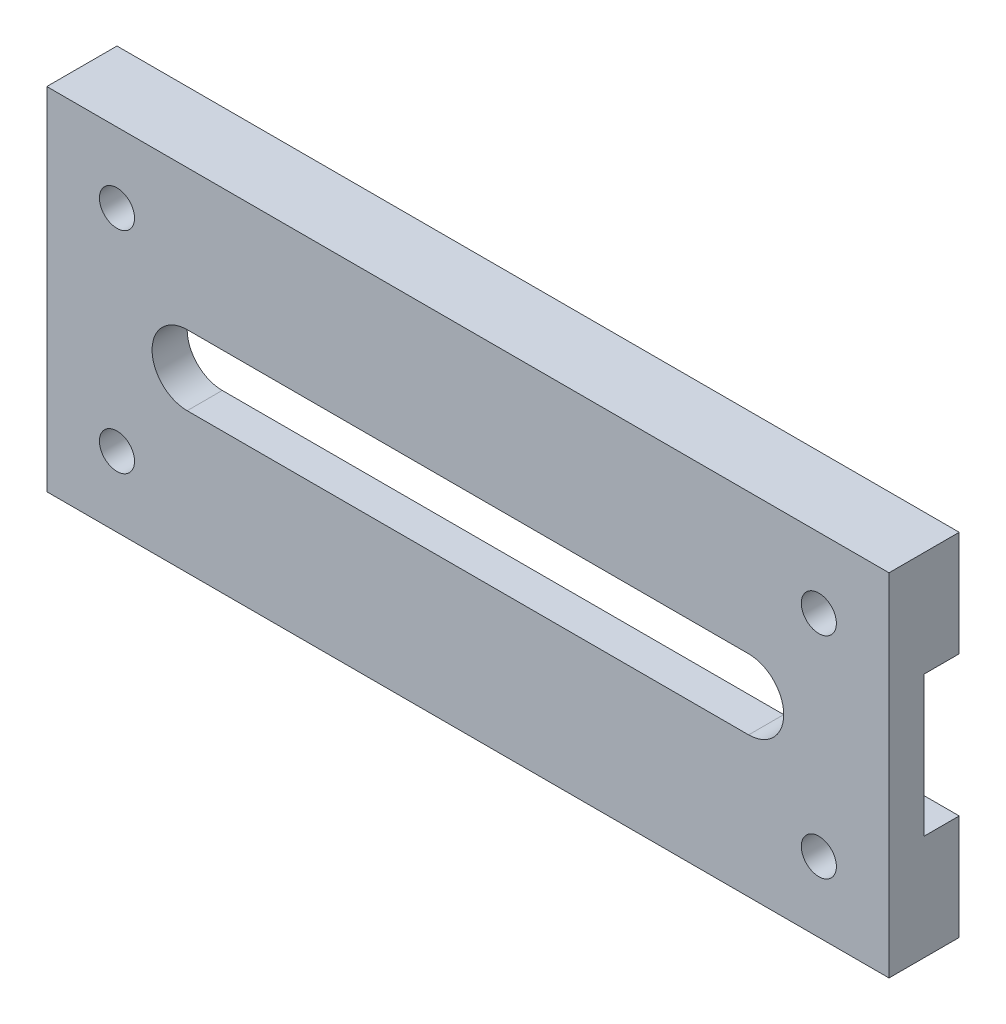
ISO-10303-21;
HEADER;
FILE_DESCRIPTION(('STEP AP214'),'2;1');
FILE_NAME('part.step','',(''),(''),'','','');
FILE_SCHEMA(('AUTOMOTIVE_DESIGN { 1 0 10303 214 1 1 1 1 }'));
ENDSEC;
DATA;
#1=APPLICATION_CONTEXT('core data for automotive mechanical design processes');
#2=APPLICATION_PROTOCOL_DEFINITION('international standard','automotive_design',2000,#1);
#3=PRODUCT_CONTEXT('',#1,'mechanical');
#4=PRODUCT('Part','Part','',(#3));
#5=PRODUCT_RELATED_PRODUCT_CATEGORY('part','',(#4));
#6=PRODUCT_DEFINITION_FORMATION('','',#4);
#7=PRODUCT_DEFINITION_CONTEXT('part definition',#1,'design');
#8=PRODUCT_DEFINITION('design','',#6,#7);
#9=PRODUCT_DEFINITION_SHAPE('','',#8);
#10=(LENGTH_UNIT() NAMED_UNIT(*) SI_UNIT(.MILLI.,.METRE.));
#11=(NAMED_UNIT(*) PLANE_ANGLE_UNIT() SI_UNIT($,.RADIAN.));
#12=(NAMED_UNIT(*) SI_UNIT($,.STERADIAN.) SOLID_ANGLE_UNIT());
#13=UNCERTAINTY_MEASURE_WITH_UNIT(LENGTH_MEASURE(1.E-05),#10,'distance_accuracy_value','');
#14=(GEOMETRIC_REPRESENTATION_CONTEXT(3) GLOBAL_UNCERTAINTY_ASSIGNED_CONTEXT((#13)) GLOBAL_UNIT_ASSIGNED_CONTEXT((#10,
#11,#12)) REPRESENTATION_CONTEXT('',''));
#15=CARTESIAN_POINT('',(0.,0.,0.));
#16=DIRECTION('',(0.,0.,1.));
#17=DIRECTION('',(1.,0.,0.));
#18=AXIS2_PLACEMENT_3D('',#15,#16,#17);
#19=CARTESIAN_POINT('',(0.,0.,0.));
#20=DIRECTION('',(0.,0.,1.));
#21=DIRECTION('',(1.,0.,0.));
#22=AXIS2_PLACEMENT_3D('',#19,#20,#21);
#23=PLANE('',#22);
#24=CARTESIAN_POINT('',(-63.5,-19.05,0.));
#25=DIRECTION('',(0.,0.,1.));
#26=DIRECTION('',(-1.,0.,0.));
#27=AXIS2_PLACEMENT_3D('',#24,#25,#26);
#28=CIRCLE('',#27,3.175);
#29=CARTESIAN_POINT('',(-66.675,-19.05,0.));
#30=VERTEX_POINT('',#29);
#31=EDGE_CURVE('E157',#30,#30,#28,.T.);
#32=ORIENTED_EDGE('',*,*,#31,.T.);
#33=EDGE_LOOP('',(#32));
#34=FACE_BOUND('',#33,.T.);
#35=CARTESIAN_POINT('',(63.5,-19.05,0.));
#36=DIRECTION('',(0.,0.,1.));
#37=DIRECTION('',(1.,0.,0.));
#38=AXIS2_PLACEMENT_3D('',#35,#36,#37);
#39=CIRCLE('',#38,3.175);
#40=CARTESIAN_POINT('',(66.675,-19.05,0.));
#41=VERTEX_POINT('',#40);
#42=EDGE_CURVE('E161',#41,#41,#39,.T.);
#43=ORIENTED_EDGE('',*,*,#42,.T.);
#44=EDGE_LOOP('',(#43));
#45=FACE_BOUND('',#44,.T.);
#46=DIRECTION('',(0.,-1.,0.));
#47=VECTOR('',#46,1.);
#48=CARTESIAN_POINT('',(-76.2,31.75,0.));
#49=LINE('',#48,#47);
#50=CARTESIAN_POINT('',(-76.2,-12.7,0.));
#51=VERTEX_POINT('',#50);
#52=CARTESIAN_POINT('',(-76.2,-31.75,0.));
#53=VERTEX_POINT('',#52);
#54=EDGE_CURVE('E218',#51,#53,#49,.T.);
#55=ORIENTED_EDGE('',*,*,#54,.F.);
#56=DIRECTION('',(1.,0.,0.));
#57=VECTOR('',#56,1.);
#58=CARTESIAN_POINT('',(0.,-12.7,0.));
#59=LINE('',#58,#57);
#60=CARTESIAN_POINT('',(76.2,-12.7,0.));
#61=VERTEX_POINT('',#60);
#62=EDGE_CURVE('E154',#51,#61,#59,.T.);
#63=ORIENTED_EDGE('',*,*,#62,.T.);
#64=DIRECTION('',(0.,1.,0.));
#65=VECTOR('',#64,1.);
#66=CARTESIAN_POINT('',(76.2,31.75,0.));
#67=LINE('',#66,#65);
#68=CARTESIAN_POINT('',(76.2,-31.75,0.));
#69=VERTEX_POINT('',#68);
#70=EDGE_CURVE('E214',#69,#61,#67,.T.);
#71=ORIENTED_EDGE('',*,*,#70,.F.);
#72=DIRECTION('',(1.,0.,0.));
#73=VECTOR('',#72,1.);
#74=CARTESIAN_POINT('',(-76.2,-31.75,0.));
#75=LINE('',#74,#73);
#76=EDGE_CURVE('E207',#53,#69,#75,.T.);
#77=ORIENTED_EDGE('',*,*,#76,.F.);
#78=EDGE_LOOP('',(#55,#63,#71,#77));
#79=FACE_BOUND('',#78,.T.);
#80=ADVANCED_FACE('F33',(#34,#45,#79),#23,.F.);
#81=CARTESIAN_POINT('',(0.,0.,12.7));
#82=DIRECTION('',(0.,0.,1.));
#83=DIRECTION('',(1.,0.,0.));
#84=AXIS2_PLACEMENT_3D('',#81,#82,#83);
#85=PLANE('',#84);
#86=CARTESIAN_POINT('',(63.5,-19.05,12.7));
#87=DIRECTION('',(0.,0.,1.));
#88=DIRECTION('',(1.,0.,0.));
#89=AXIS2_PLACEMENT_3D('',#86,#87,#88);
#90=CIRCLE('',#89,3.175);
#91=CARTESIAN_POINT('',(66.675,-19.05,12.7));
#92=VERTEX_POINT('',#91);
#93=EDGE_CURVE('E164',#92,#92,#90,.T.);
#94=ORIENTED_EDGE('',*,*,#93,.F.);
#95=EDGE_LOOP('',(#94));
#96=FACE_BOUND('',#95,.T.);
#97=CARTESIAN_POINT('',(-63.5,19.05,12.7));
#98=DIRECTION('',(0.,0.,1.));
#99=DIRECTION('',(1.,0.,0.));
#100=AXIS2_PLACEMENT_3D('',#97,#98,#99);
#101=CIRCLE('',#100,3.175);
#102=CARTESIAN_POINT('',(-60.325,19.05,12.7));
#103=VERTEX_POINT('',#102);
#104=EDGE_CURVE('E176',#103,#103,#101,.T.);
#105=ORIENTED_EDGE('',*,*,#104,.F.);
#106=EDGE_LOOP('',(#105));
#107=FACE_BOUND('',#106,.T.);
#108=DIRECTION('',(0.,1.,0.));
#109=VECTOR('',#108,1.);
#110=CARTESIAN_POINT('',(76.2,31.75,12.7));
#111=LINE('',#110,#109);
#112=CARTESIAN_POINT('',(76.2,-31.75,12.7));
#113=VERTEX_POINT('',#112);
#114=CARTESIAN_POINT('',(76.2,31.75,12.7));
#115=VERTEX_POINT('',#114);
#116=EDGE_CURVE('E203',#113,#115,#111,.T.);
#117=ORIENTED_EDGE('',*,*,#116,.T.);
#118=DIRECTION('',(-1.,0.,0.));
#119=VECTOR('',#118,1.);
#120=CARTESIAN_POINT('',(-76.2,31.75,12.7));
#121=LINE('',#120,#119);
#122=CARTESIAN_POINT('',(-76.2,31.75,12.7));
#123=VERTEX_POINT('',#122);
#124=EDGE_CURVE('E206',#115,#123,#121,.T.);
#125=ORIENTED_EDGE('',*,*,#124,.T.);
#126=DIRECTION('',(0.,-1.,0.));
#127=VECTOR('',#126,1.);
#128=CARTESIAN_POINT('',(-76.2,31.75,12.7));
#129=LINE('',#128,#127);
#130=CARTESIAN_POINT('',(-76.2,-31.75,12.7));
#131=VERTEX_POINT('',#130);
#132=EDGE_CURVE('E209',#123,#131,#129,.T.);
#133=ORIENTED_EDGE('',*,*,#132,.T.);
#134=DIRECTION('',(1.,0.,0.));
#135=VECTOR('',#134,1.);
#136=CARTESIAN_POINT('',(-76.2,-31.75,12.7));
#137=LINE('',#136,#135);
#138=EDGE_CURVE('E211',#131,#113,#137,.T.);
#139=ORIENTED_EDGE('',*,*,#138,.T.);
#140=EDGE_LOOP('',(#117,#125,#133,#139));
#141=FACE_BOUND('',#140,.T.);
#142=DIRECTION('',(1.,0.,0.));
#143=VECTOR('',#142,1.);
#144=CARTESIAN_POINT('',(-50.8,-6.35000000000002,12.7));
#145=LINE('',#144,#143);
#146=CARTESIAN_POINT('',(-50.8,-6.35000000000002,12.7));
#147=VERTEX_POINT('',#146);
#148=CARTESIAN_POINT('',(50.8,-6.35,12.7));
#149=VERTEX_POINT('',#148);
#150=EDGE_CURVE('E183',#147,#149,#145,.T.);
#151=ORIENTED_EDGE('',*,*,#150,.F.);
#152=CARTESIAN_POINT('',(-50.8,0.,12.7));
#153=DIRECTION('',(0.,0.,1.));
#154=DIRECTION('',(1.,0.,0.));
#155=AXIS2_PLACEMENT_3D('',#152,#153,#154);
#156=CIRCLE('',#155,6.35000000000002);
#157=CARTESIAN_POINT('',(-50.8,6.35000000000002,12.7));
#158=VERTEX_POINT('',#157);
#159=EDGE_CURVE('E179',#158,#147,#156,.T.);
#160=ORIENTED_EDGE('',*,*,#159,.F.);
#161=DIRECTION('',(-1.,0.,0.));
#162=VECTOR('',#161,1.);
#163=CARTESIAN_POINT('',(-50.8,6.35000000000002,12.7));
#164=LINE('',#163,#162);
#165=CARTESIAN_POINT('',(50.8,6.35000000000004,12.7));
#166=VERTEX_POINT('',#165);
#167=EDGE_CURVE('E188',#166,#158,#164,.T.);
#168=ORIENTED_EDGE('',*,*,#167,.F.);
#169=CARTESIAN_POINT('',(50.8,0.,12.7));
#170=DIRECTION('',(0.,0.,1.));
#171=DIRECTION('',(1.,0.,0.));
#172=AXIS2_PLACEMENT_3D('',#169,#170,#171);
#173=CIRCLE('',#172,6.35000000000002);
#174=EDGE_CURVE('E185',#149,#166,#173,.T.);
#175=ORIENTED_EDGE('',*,*,#174,.F.);
#176=EDGE_LOOP('',(#151,#160,#168,#175));
#177=FACE_BOUND('',#176,.T.);
#178=CARTESIAN_POINT('',(63.5,19.05,12.7));
#179=DIRECTION('',(0.,0.,1.));
#180=DIRECTION('',(-1.,0.,0.));
#181=AXIS2_PLACEMENT_3D('',#178,#179,#180);
#182=CIRCLE('',#181,3.175);
#183=CARTESIAN_POINT('',(60.325,19.05,12.7));
#184=VERTEX_POINT('',#183);
#185=EDGE_CURVE('E170',#184,#184,#182,.T.);
#186=ORIENTED_EDGE('',*,*,#185,.F.);
#187=EDGE_LOOP('',(#186));
#188=FACE_BOUND('',#187,.T.);
#189=CARTESIAN_POINT('',(-63.5,-19.05,12.7));
#190=DIRECTION('',(0.,0.,1.));
#191=DIRECTION('',(-1.,0.,0.));
#192=AXIS2_PLACEMENT_3D('',#189,#190,#191);
#193=CIRCLE('',#192,3.175);
#194=CARTESIAN_POINT('',(-66.675,-19.05,12.7));
#195=VERTEX_POINT('',#194);
#196=EDGE_CURVE('E158',#195,#195,#193,.T.);
#197=ORIENTED_EDGE('',*,*,#196,.F.);
#198=EDGE_LOOP('',(#197));
#199=FACE_BOUND('',#198,.T.);
#200=ADVANCED_FACE('F246',(#96,#107,#141,#177,#188,#199),#85,.T.);
#201=CARTESIAN_POINT('',(76.2,12.7,0.));
#202=VERTEX_POINT('',#201);
#203=CARTESIAN_POINT('',(76.2,31.75,0.));
#204=VERTEX_POINT('',#203);
#205=EDGE_CURVE('E202',#202,#204,#67,.T.);
#206=ORIENTED_EDGE('',*,*,#205,.F.);
#207=DIRECTION('',(-1.,0.,0.));
#208=VECTOR('',#207,1.);
#209=CARTESIAN_POINT('',(0.,12.7,0.));
#210=LINE('',#209,#208);
#211=CARTESIAN_POINT('',(-76.2,12.7,0.));
#212=VERTEX_POINT('',#211);
#213=EDGE_CURVE('E136',#202,#212,#210,.T.);
#214=ORIENTED_EDGE('',*,*,#213,.T.);
#215=CARTESIAN_POINT('',(-76.2,31.75,0.));
#216=VERTEX_POINT('',#215);
#217=EDGE_CURVE('E219',#216,#212,#49,.T.);
#218=ORIENTED_EDGE('',*,*,#217,.F.);
#219=DIRECTION('',(-1.,0.,0.));
#220=VECTOR('',#219,1.);
#221=CARTESIAN_POINT('',(-76.2,31.75,0.));
#222=LINE('',#221,#220);
#223=EDGE_CURVE('E216',#204,#216,#222,.T.);
#224=ORIENTED_EDGE('',*,*,#223,.F.);
#225=EDGE_LOOP('',(#206,#214,#218,#224));
#226=FACE_BOUND('',#225,.T.);
#227=CARTESIAN_POINT('',(-63.5,19.05,0.));
#228=DIRECTION('',(0.,0.,1.));
#229=DIRECTION('',(1.,0.,0.));
#230=AXIS2_PLACEMENT_3D('',#227,#228,#229);
#231=CIRCLE('',#230,3.175);
#232=CARTESIAN_POINT('',(-60.325,19.05,0.));
#233=VERTEX_POINT('',#232);
#234=EDGE_CURVE('E173',#233,#233,#231,.T.);
#235=ORIENTED_EDGE('',*,*,#234,.T.);
#236=EDGE_LOOP('',(#235));
#237=FACE_BOUND('',#236,.T.);
#238=CARTESIAN_POINT('',(63.5,19.05,0.));
#239=DIRECTION('',(0.,0.,1.));
#240=DIRECTION('',(-1.,0.,0.));
#241=AXIS2_PLACEMENT_3D('',#238,#239,#240);
#242=CIRCLE('',#241,3.175);
#243=CARTESIAN_POINT('',(60.325,19.05,0.));
#244=VERTEX_POINT('',#243);
#245=EDGE_CURVE('E167',#244,#244,#242,.T.);
#246=ORIENTED_EDGE('',*,*,#245,.T.);
#247=EDGE_LOOP('',(#246));
#248=FACE_BOUND('',#247,.T.);
#249=ADVANCED_FACE('F265',(#226,#237,#248),#23,.F.);
#250=CARTESIAN_POINT('',(76.2,31.75,12.7));
#251=DIRECTION('',(-1.,0.,0.));
#252=DIRECTION('',(0.,0.,1.));
#253=AXIS2_PLACEMENT_3D('',#250,#251,#252);
#254=PLANE('',#253);
#255=ORIENTED_EDGE('',*,*,#70,.T.);
#256=DIRECTION('',(0.,0.,1.));
#257=VECTOR('',#256,1.);
#258=CARTESIAN_POINT('',(76.2,-12.7,-6.35));
#259=LINE('',#258,#257);
#260=CARTESIAN_POINT('',(76.2,-12.7,6.35));
#261=VERTEX_POINT('',#260);
#262=EDGE_CURVE('E130',#61,#261,#259,.T.);
#263=ORIENTED_EDGE('',*,*,#262,.T.);
#264=DIRECTION('',(0.,1.,0.));
#265=VECTOR('',#264,1.);
#266=CARTESIAN_POINT('',(76.2,12.7,6.35));
#267=LINE('',#266,#265);
#268=CARTESIAN_POINT('',(76.2,12.7,6.35));
#269=VERTEX_POINT('',#268);
#270=EDGE_CURVE('E125',#261,#269,#267,.T.);
#271=ORIENTED_EDGE('',*,*,#270,.T.);
#272=DIRECTION('',(0.,0.,-1.));
#273=VECTOR('',#272,1.);
#274=CARTESIAN_POINT('',(76.2,12.7,-6.35));
#275=LINE('',#274,#273);
#276=EDGE_CURVE('E133',#269,#202,#275,.T.);
#277=ORIENTED_EDGE('',*,*,#276,.T.);
#278=ORIENTED_EDGE('',*,*,#205,.T.);
#279=DIRECTION('',(0.,0.,-1.));
#280=VECTOR('',#279,1.);
#281=CARTESIAN_POINT('',(76.2,31.75,12.7));
#282=LINE('',#281,#280);
#283=EDGE_CURVE('E231',#115,#204,#282,.T.);
#284=ORIENTED_EDGE('',*,*,#283,.F.);
#285=ORIENTED_EDGE('',*,*,#116,.F.);
#286=DIRECTION('',(0.,0.,-1.));
#287=VECTOR('',#286,1.);
#288=CARTESIAN_POINT('',(76.2,-31.75,12.7));
#289=LINE('',#288,#287);
#290=EDGE_CURVE('E213',#113,#69,#289,.T.);
#291=ORIENTED_EDGE('',*,*,#290,.T.);
#292=EDGE_LOOP('',(#255,#263,#271,#277,#278,#284,#285,#291));
#293=FACE_BOUND('',#292,.T.);
#294=ADVANCED_FACE('F35',(#293),#254,.F.);
#295=CARTESIAN_POINT('',(-76.2,31.75,12.7));
#296=DIRECTION('',(0.,-1.,0.));
#297=DIRECTION('',(0.,0.,-1.));
#298=AXIS2_PLACEMENT_3D('',#295,#296,#297);
#299=PLANE('',#298);
#300=ORIENTED_EDGE('',*,*,#223,.T.);
#301=DIRECTION('',(0.,0.,-1.));
#302=VECTOR('',#301,1.);
#303=CARTESIAN_POINT('',(-76.2,31.75,12.7));
#304=LINE('',#303,#302);
#305=EDGE_CURVE('E228',#123,#216,#304,.T.);
#306=ORIENTED_EDGE('',*,*,#305,.F.);
#307=ORIENTED_EDGE('',*,*,#124,.F.);
#308=ORIENTED_EDGE('',*,*,#283,.T.);
#309=EDGE_LOOP('',(#300,#306,#307,#308));
#310=FACE_BOUND('',#309,.T.);
#311=ADVANCED_FACE('F278',(#310),#299,.F.);
#312=CARTESIAN_POINT('',(-76.2,31.75,12.7));
#313=DIRECTION('',(1.,0.,0.));
#314=DIRECTION('',(0.,0.,-1.));
#315=AXIS2_PLACEMENT_3D('',#312,#313,#314);
#316=PLANE('',#315);
#317=DIRECTION('',(0.,1.,0.));
#318=VECTOR('',#317,1.);
#319=CARTESIAN_POINT('',(-76.2,12.7,6.35));
#320=LINE('',#319,#318);
#321=CARTESIAN_POINT('',(-76.2,-12.7,6.35));
#322=VERTEX_POINT('',#321);
#323=CARTESIAN_POINT('',(-76.2,12.7,6.35));
#324=VERTEX_POINT('',#323);
#325=EDGE_CURVE('E48',#322,#324,#320,.T.);
#326=ORIENTED_EDGE('',*,*,#325,.F.);
#327=DIRECTION('',(0.,0.,-1.));
#328=VECTOR('',#327,1.);
#329=CARTESIAN_POINT('',(-76.2,-12.7,12.7));
#330=LINE('',#329,#328);
#331=EDGE_CURVE('E11',#322,#51,#330,.T.);
#332=ORIENTED_EDGE('',*,*,#331,.T.);
#333=ORIENTED_EDGE('',*,*,#54,.T.);
#334=DIRECTION('',(0.,0.,-1.));
#335=VECTOR('',#334,1.);
#336=CARTESIAN_POINT('',(-76.2,-31.75,12.7));
#337=LINE('',#336,#335);
#338=EDGE_CURVE('E225',#131,#53,#337,.T.);
#339=ORIENTED_EDGE('',*,*,#338,.F.);
#340=ORIENTED_EDGE('',*,*,#132,.F.);
#341=ORIENTED_EDGE('',*,*,#305,.T.);
#342=ORIENTED_EDGE('',*,*,#217,.T.);
#343=DIRECTION('',(0.,0.,-1.));
#344=VECTOR('',#343,1.);
#345=CARTESIAN_POINT('',(-76.2,12.7,-6.35));
#346=LINE('',#345,#344);
#347=EDGE_CURVE('E141',#324,#212,#346,.T.);
#348=ORIENTED_EDGE('',*,*,#347,.F.);
#349=EDGE_LOOP('',(#326,#332,#333,#339,#340,#341,#342,#348));
#350=FACE_BOUND('',#349,.T.);
#351=ADVANCED_FACE('F314',(#350),#316,.F.);
#352=CARTESIAN_POINT('',(-76.2,-31.75,12.7));
#353=DIRECTION('',(0.,1.,0.));
#354=DIRECTION('',(0.,0.,1.));
#355=AXIS2_PLACEMENT_3D('',#352,#353,#354);
#356=PLANE('',#355);
#357=ORIENTED_EDGE('',*,*,#76,.T.);
#358=ORIENTED_EDGE('',*,*,#290,.F.);
#359=ORIENTED_EDGE('',*,*,#138,.F.);
#360=ORIENTED_EDGE('',*,*,#338,.T.);
#361=EDGE_LOOP('',(#357,#358,#359,#360));
#362=FACE_BOUND('',#361,.T.);
#363=ADVANCED_FACE('F327',(#362),#356,.F.);
#364=CARTESIAN_POINT('',(-50.8,0.,12.7));
#365=DIRECTION('',(0.,0.,-1.));
#366=DIRECTION('',(-1.,0.,0.));
#367=AXIS2_PLACEMENT_3D('',#364,#365,#366);
#368=CYLINDRICAL_SURFACE('',#367,6.35000000000002);
#369=CARTESIAN_POINT('',(-50.8,0.,6.35));
#370=DIRECTION('',(0.,0.,1.));
#371=DIRECTION('',(0.,-1.,0.));
#372=AXIS2_PLACEMENT_3D('',#369,#370,#371);
#373=CIRCLE('',#372,6.35000000000002);
#374=CARTESIAN_POINT('',(-50.8,6.35000000000002,6.35));
#375=VERTEX_POINT('',#374);
#376=CARTESIAN_POINT('',(-50.8,-6.35000000000002,6.35));
#377=VERTEX_POINT('',#376);
#378=EDGE_CURVE('E151',#375,#377,#373,.T.);
#379=ORIENTED_EDGE('',*,*,#378,.F.);
#380=DIRECTION('',(0.,0.,-1.));
#381=VECTOR('',#380,1.);
#382=CARTESIAN_POINT('',(-50.8,6.35000000000002,12.7));
#383=LINE('',#382,#381);
#384=EDGE_CURVE('E190',#158,#375,#383,.T.);
#385=ORIENTED_EDGE('',*,*,#384,.F.);
#386=ORIENTED_EDGE('',*,*,#159,.T.);
#387=DIRECTION('',(0.,0.,-1.));
#388=VECTOR('',#387,1.);
#389=CARTESIAN_POINT('',(-50.8,-6.35000000000002,12.7));
#390=LINE('',#389,#388);
#391=EDGE_CURVE('E199',#147,#377,#390,.T.);
#392=ORIENTED_EDGE('',*,*,#391,.T.);
#393=EDGE_LOOP('',(#379,#385,#386,#392));
#394=FACE_BOUND('',#393,.T.);
#395=ADVANCED_FACE('F238',(#394),#368,.F.);
#396=CARTESIAN_POINT('',(-50.8,-6.35000000000002,12.7));
#397=DIRECTION('',(0.,1.,0.));
#398=DIRECTION('',(-1.,0.,0.));
#399=AXIS2_PLACEMENT_3D('',#396,#397,#398);
#400=PLANE('',#399);
#401=DIRECTION('',(1.,0.,0.));
#402=VECTOR('',#401,1.);
#403=CARTESIAN_POINT('',(-50.8,-6.35000000000002,6.35));
#404=LINE('',#403,#402);
#405=CARTESIAN_POINT('',(50.8,-6.35,6.35));
#406=VERTEX_POINT('',#405);
#407=EDGE_CURVE('E149',#377,#406,#404,.T.);
#408=ORIENTED_EDGE('',*,*,#407,.F.);
#409=ORIENTED_EDGE('',*,*,#391,.F.);
#410=ORIENTED_EDGE('',*,*,#150,.T.);
#411=DIRECTION('',(0.,0.,-1.));
#412=VECTOR('',#411,1.);
#413=CARTESIAN_POINT('',(50.8,-6.35,12.7));
#414=LINE('',#413,#412);
#415=EDGE_CURVE('E196',#149,#406,#414,.T.);
#416=ORIENTED_EDGE('',*,*,#415,.T.);
#417=EDGE_LOOP('',(#408,#409,#410,#416));
#418=FACE_BOUND('',#417,.T.);
#419=ADVANCED_FACE('F249',(#418),#400,.T.);
#420=CARTESIAN_POINT('',(50.8,0.,12.7));
#421=DIRECTION('',(0.,0.,-1.));
#422=DIRECTION('',(-1.,0.,0.));
#423=AXIS2_PLACEMENT_3D('',#420,#421,#422);
#424=CYLINDRICAL_SURFACE('',#423,6.35000000000002);
#425=CARTESIAN_POINT('',(50.8,0.,6.35));
#426=DIRECTION('',(0.,0.,1.));
#427=DIRECTION('',(0.,-1.,0.));
#428=AXIS2_PLACEMENT_3D('',#425,#426,#427);
#429=CIRCLE('',#428,6.35000000000002);
#430=CARTESIAN_POINT('',(50.8,6.35000000000004,6.35));
#431=VERTEX_POINT('',#430);
#432=EDGE_CURVE('E56',#406,#431,#429,.T.);
#433=ORIENTED_EDGE('',*,*,#432,.F.);
#434=ORIENTED_EDGE('',*,*,#415,.F.);
#435=ORIENTED_EDGE('',*,*,#174,.T.);
#436=DIRECTION('',(0.,0.,-1.));
#437=VECTOR('',#436,1.);
#438=CARTESIAN_POINT('',(50.8,6.35000000000004,12.7));
#439=LINE('',#438,#437);
#440=EDGE_CURVE('E193',#166,#431,#439,.T.);
#441=ORIENTED_EDGE('',*,*,#440,.T.);
#442=EDGE_LOOP('',(#433,#434,#435,#441));
#443=FACE_BOUND('',#442,.T.);
#444=ADVANCED_FACE('F252',(#443),#424,.F.);
#445=CARTESIAN_POINT('',(-50.8,6.35000000000002,12.7));
#446=DIRECTION('',(0.,-1.,0.));
#447=DIRECTION('',(1.,0.,0.));
#448=AXIS2_PLACEMENT_3D('',#445,#446,#447);
#449=PLANE('',#448);
#450=DIRECTION('',(-1.,0.,0.));
#451=VECTOR('',#450,1.);
#452=CARTESIAN_POINT('',(-50.8,6.35000000000002,6.35));
#453=LINE('',#452,#451);
#454=EDGE_CURVE('E41',#431,#375,#453,.T.);
#455=ORIENTED_EDGE('',*,*,#454,.F.);
#456=ORIENTED_EDGE('',*,*,#440,.F.);
#457=ORIENTED_EDGE('',*,*,#167,.T.);
#458=ORIENTED_EDGE('',*,*,#384,.T.);
#459=EDGE_LOOP('',(#455,#456,#457,#458));
#460=FACE_BOUND('',#459,.T.);
#461=ADVANCED_FACE('F241',(#460),#449,.T.);
#462=CARTESIAN_POINT('',(-63.5,19.05,12.7));
#463=DIRECTION('',(0.,0.,-1.));
#464=DIRECTION('',(-1.,0.,0.));
#465=AXIS2_PLACEMENT_3D('',#462,#463,#464);
#466=CYLINDRICAL_SURFACE('',#465,3.175);
#467=ORIENTED_EDGE('',*,*,#104,.T.);
#468=EDGE_LOOP('',(#467));
#469=FACE_BOUND('',#468,.T.);
#470=ORIENTED_EDGE('',*,*,#234,.F.);
#471=EDGE_LOOP('',(#470));
#472=FACE_BOUND('',#471,.T.);
#473=ADVANCED_FACE('F259',(#469,#472),#466,.F.);
#474=CARTESIAN_POINT('',(63.5,19.05,12.7));
#475=DIRECTION('',(0.,0.,-1.));
#476=DIRECTION('',(-1.,0.,0.));
#477=AXIS2_PLACEMENT_3D('',#474,#475,#476);
#478=CYLINDRICAL_SURFACE('',#477,3.175);
#479=ORIENTED_EDGE('',*,*,#185,.T.);
#480=EDGE_LOOP('',(#479));
#481=FACE_BOUND('',#480,.T.);
#482=ORIENTED_EDGE('',*,*,#245,.F.);
#483=EDGE_LOOP('',(#482));
#484=FACE_BOUND('',#483,.T.);
#485=ADVANCED_FACE('F285',(#481,#484),#478,.F.);
#486=CARTESIAN_POINT('',(63.5,-19.05,12.7));
#487=DIRECTION('',(0.,0.,-1.));
#488=DIRECTION('',(-1.,0.,0.));
#489=AXIS2_PLACEMENT_3D('',#486,#487,#488);
#490=CYLINDRICAL_SURFACE('',#489,3.175);
#491=ORIENTED_EDGE('',*,*,#93,.T.);
#492=EDGE_LOOP('',(#491));
#493=FACE_BOUND('',#492,.T.);
#494=ORIENTED_EDGE('',*,*,#42,.F.);
#495=EDGE_LOOP('',(#494));
#496=FACE_BOUND('',#495,.T.);
#497=ADVANCED_FACE('F287',(#493,#496),#490,.F.);
#498=CARTESIAN_POINT('',(-63.5,-19.05,12.7));
#499=DIRECTION('',(0.,0.,-1.));
#500=DIRECTION('',(-1.,0.,0.));
#501=AXIS2_PLACEMENT_3D('',#498,#499,#500);
#502=CYLINDRICAL_SURFACE('',#501,3.175);
#503=ORIENTED_EDGE('',*,*,#196,.T.);
#504=EDGE_LOOP('',(#503));
#505=FACE_BOUND('',#504,.T.);
#506=ORIENTED_EDGE('',*,*,#31,.F.);
#507=EDGE_LOOP('',(#506));
#508=FACE_BOUND('',#507,.T.);
#509=ADVANCED_FACE('F294',(#505,#508),#502,.F.);
#510=CARTESIAN_POINT('',(76.2,-12.7,-6.35));
#511=DIRECTION('',(0.,-1.,0.));
#512=DIRECTION('',(0.,0.,-1.));
#513=AXIS2_PLACEMENT_3D('',#510,#511,#512);
#514=PLANE('',#513);
#515=ORIENTED_EDGE('',*,*,#331,.F.);
#516=DIRECTION('',(-1.,0.,0.));
#517=VECTOR('',#516,1.);
#518=CARTESIAN_POINT('',(76.2,-12.7,6.35));
#519=LINE('',#518,#517);
#520=EDGE_CURVE('E129',#261,#322,#519,.T.);
#521=ORIENTED_EDGE('',*,*,#520,.F.);
#522=ORIENTED_EDGE('',*,*,#262,.F.);
#523=ORIENTED_EDGE('',*,*,#62,.F.);
#524=EDGE_LOOP('',(#515,#521,#522,#523));
#525=FACE_BOUND('',#524,.T.);
#526=ADVANCED_FACE('F302',(#525),#514,.F.);
#527=CARTESIAN_POINT('',(76.2,12.7,-6.35));
#528=DIRECTION('',(0.,1.,0.));
#529=DIRECTION('',(0.,0.,1.));
#530=AXIS2_PLACEMENT_3D('',#527,#528,#529);
#531=PLANE('',#530);
#532=ORIENTED_EDGE('',*,*,#276,.F.);
#533=DIRECTION('',(-1.,0.,0.));
#534=VECTOR('',#533,1.);
#535=CARTESIAN_POINT('',(76.2,12.7,6.35));
#536=LINE('',#535,#534);
#537=EDGE_CURVE('E121',#269,#324,#536,.T.);
#538=ORIENTED_EDGE('',*,*,#537,.T.);
#539=ORIENTED_EDGE('',*,*,#347,.T.);
#540=ORIENTED_EDGE('',*,*,#213,.F.);
#541=EDGE_LOOP('',(#532,#538,#539,#540));
#542=FACE_BOUND('',#541,.T.);
#543=ADVANCED_FACE('F134',(#542),#531,.F.);
#544=CARTESIAN_POINT('',(76.2,12.7,6.35));
#545=DIRECTION('',(0.,0.,1.));
#546=DIRECTION('',(0.,-1.,0.));
#547=AXIS2_PLACEMENT_3D('',#544,#545,#546);
#548=PLANE('',#547);
#549=ORIENTED_EDGE('',*,*,#378,.T.);
#550=ORIENTED_EDGE('',*,*,#407,.T.);
#551=ORIENTED_EDGE('',*,*,#432,.T.);
#552=ORIENTED_EDGE('',*,*,#454,.T.);
#553=EDGE_LOOP('',(#549,#550,#551,#552));
#554=FACE_BOUND('',#553,.T.);
#555=ORIENTED_EDGE('',*,*,#325,.T.);
#556=ORIENTED_EDGE('',*,*,#537,.F.);
#557=ORIENTED_EDGE('',*,*,#270,.F.);
#558=ORIENTED_EDGE('',*,*,#520,.T.);
#559=EDGE_LOOP('',(#555,#556,#557,#558));
#560=FACE_BOUND('',#559,.T.);
#561=ADVANCED_FACE('F123',(#554,#560),#548,.F.);
#562=CLOSED_SHELL('',(#80,#200,#249,#294,#311,#351,#363,#395,#419,#444,#461,#473,#485,#497,#509,
#526,#543,#561));
#563=MANIFOLD_SOLID_BREP('B2',#562);
#564=ADVANCED_BREP_SHAPE_REPRESENTATION('',(#18,#563),#14);
#565=SHAPE_DEFINITION_REPRESENTATION(#9,#564);
ENDSEC;
END-ISO-10303-21;
